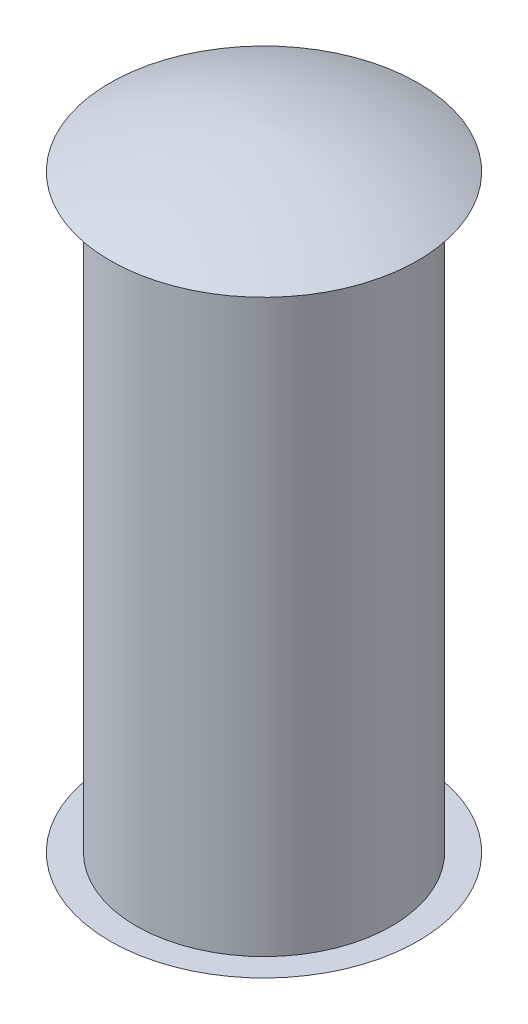
ISO-10303-21;
HEADER;
FILE_DESCRIPTION(('STEP AP214'),'2;1');
FILE_NAME('part.step','',(''),(''),'','','');
FILE_SCHEMA(('AUTOMOTIVE_DESIGN { 1 0 10303 214 1 1 1 1 }'));
ENDSEC;
DATA;
#1=APPLICATION_CONTEXT('core data for automotive mechanical design processes');
#2=APPLICATION_PROTOCOL_DEFINITION('international standard','automotive_design',2000,#1);
#3=PRODUCT_CONTEXT('',#1,'mechanical');
#4=PRODUCT('Part','Part','',(#3));
#5=PRODUCT_RELATED_PRODUCT_CATEGORY('part','',(#4));
#6=PRODUCT_DEFINITION_FORMATION('','',#4);
#7=PRODUCT_DEFINITION_CONTEXT('part definition',#1,'design');
#8=PRODUCT_DEFINITION('design','',#6,#7);
#9=PRODUCT_DEFINITION_SHAPE('','',#8);
#10=(LENGTH_UNIT() NAMED_UNIT(*) SI_UNIT(.MILLI.,.METRE.));
#11=(NAMED_UNIT(*) PLANE_ANGLE_UNIT() SI_UNIT($,.RADIAN.));
#12=(NAMED_UNIT(*) SI_UNIT($,.STERADIAN.) SOLID_ANGLE_UNIT());
#13=UNCERTAINTY_MEASURE_WITH_UNIT(LENGTH_MEASURE(1.E-05),#10,'distance_accuracy_value','');
#14=(GEOMETRIC_REPRESENTATION_CONTEXT(3) GLOBAL_UNCERTAINTY_ASSIGNED_CONTEXT((#13)) GLOBAL_UNIT_ASSIGNED_CONTEXT((#10,
#11,#12)) REPRESENTATION_CONTEXT('',''));
#15=CARTESIAN_POINT('',(0.,0.,0.));
#16=DIRECTION('',(0.,0.,1.));
#17=DIRECTION('',(1.,0.,0.));
#18=AXIS2_PLACEMENT_3D('',#15,#16,#17);
#19=CARTESIAN_POINT('',(0.,22.5,0.));
#20=DIRECTION('',(0.,-1.,0.));
#21=DIRECTION('',(0.,0.,-1.));
#22=AXIS2_PLACEMENT_3D('',#19,#20,#21);
#23=CYLINDRICAL_SURFACE('',#22,9.75);
#24=CARTESIAN_POINT('',(0.,22.5,0.));
#25=DIRECTION('',(0.,1.,0.));
#26=DIRECTION('',(0.,0.,1.));
#27=AXIS2_PLACEMENT_3D('',#24,#25,#26);
#28=CIRCLE('',#27,9.75);
#29=CARTESIAN_POINT('',(0.,22.5,9.75));
#30=VERTEX_POINT('',#29);
#31=EDGE_CURVE('E13',#30,#30,#28,.T.);
#32=ORIENTED_EDGE('',*,*,#31,.F.);
#33=EDGE_LOOP('',(#32));
#34=FACE_BOUND('',#33,.T.);
#35=CARTESIAN_POINT('',(0.,-22.5,0.));
#36=DIRECTION('',(0.,1.,0.));
#37=DIRECTION('',(0.,0.,1.));
#38=AXIS2_PLACEMENT_3D('',#35,#36,#37);
#39=CIRCLE('',#38,9.75);
#40=CARTESIAN_POINT('',(0.,-22.5,9.75));
#41=VERTEX_POINT('',#40);
#42=EDGE_CURVE('E67',#41,#41,#39,.T.);
#43=ORIENTED_EDGE('',*,*,#42,.T.);
#44=EDGE_LOOP('',(#43));
#45=FACE_BOUND('',#44,.T.);
#46=ADVANCED_FACE('F44',(#34,#45),#23,.T.);
#47=CARTESIAN_POINT('',(0.,-4.46762638446654,1.39333014071486));
#48=DIRECTION('',(-1.,0.,0.));
#49=DIRECTION('',(0.,0.,-1.));
#50=AXIS2_PLACEMENT_3D('',#47,#48,#49);
#51=CIRCLE('',#50,30.);
#52=TRIMMED_CURVE('',#51,(PARAMETER_VALUE(-1.52433527521043)),
(PARAMETER_VALUE(1.52433527521043)),.T.,.PARAMETER.);
#53=CARTESIAN_POINT('',(0.,-4.46762638446654,0.));
#54=DIRECTION('',(0.,-1.,0.));
#55=AXIS1_PLACEMENT('',#53,#54);
#56=SURFACE_OF_REVOLUTION('',#52,#55);
#57=CARTESIAN_POINT('',(0.,25.5,0.));
#58=VERTEX_POINT('',#57);
#59=VERTEX_LOOP('',#58);
#60=FACE_BOUND('',#59,.T.);
#61=CARTESIAN_POINT('',(0.,22.5,0.));
#62=DIRECTION('',(0.,-1.,0.));
#63=DIRECTION('',(0.,0.,-1.));
#64=AXIS2_PLACEMENT_3D('',#61,#62,#63);
#65=CIRCLE('',#64,11.75);
#66=CARTESIAN_POINT('',(0.,22.5,-11.75));
#67=VERTEX_POINT('',#66);
#68=EDGE_CURVE('E51',#67,#67,#65,.T.);
#69=ORIENTED_EDGE('',*,*,#68,.F.);
#70=EDGE_LOOP('',(#69));
#71=FACE_BOUND('',#70,.T.);
#72=ADVANCED_FACE('F75',(#60,#71),#56,.T.);
#73=CARTESIAN_POINT('',(0.,22.5,0.));
#74=DIRECTION('',(0.,-1.,0.));
#75=DIRECTION('',(0.,0.,-1.));
#76=AXIS2_PLACEMENT_3D('',#73,#74,#75);
#77=PLANE('',#76);
#78=ORIENTED_EDGE('',*,*,#31,.T.);
#79=EDGE_LOOP('',(#78));
#80=FACE_BOUND('',#79,.T.);
#81=ORIENTED_EDGE('',*,*,#68,.T.);
#82=EDGE_LOOP('',(#81));
#83=FACE_BOUND('',#82,.T.);
#84=ADVANCED_FACE('F61',(#80,#83),#77,.T.);
#85=CARTESIAN_POINT('',(0.,4.46762638446654,1.39333014071486));
#86=DIRECTION('',(1.,0.,0.));
#87=DIRECTION('',(0.,0.,-1.));
#88=AXIS2_PLACEMENT_3D('',#85,#86,#87);
#89=CIRCLE('',#88,30.);
#90=TRIMMED_CURVE('',#89,(PARAMETER_VALUE(-1.52433527521043)),
(PARAMETER_VALUE(1.52433527521043)),.T.,.PARAMETER.);
#91=CARTESIAN_POINT('',(0.,4.46762638446654,0.));
#92=DIRECTION('',(0.,1.,0.));
#93=AXIS1_PLACEMENT('',#91,#92);
#94=SURFACE_OF_REVOLUTION('',#90,#93);
#95=CARTESIAN_POINT('',(0.,-25.5,0.));
#96=VERTEX_POINT('',#95);
#97=VERTEX_LOOP('',#96);
#98=FACE_BOUND('',#97,.T.);
#99=CARTESIAN_POINT('',(0.,-22.5,0.));
#100=DIRECTION('',(0.,-1.,0.));
#101=DIRECTION('',(0.,0.,-1.));
#102=AXIS2_PLACEMENT_3D('',#99,#100,#101);
#103=CIRCLE('',#102,11.75);
#104=CARTESIAN_POINT('',(0.,-22.5,-11.75));
#105=VERTEX_POINT('',#104);
#106=EDGE_CURVE('E65',#105,#105,#103,.T.);
#107=ORIENTED_EDGE('',*,*,#106,.T.);
#108=EDGE_LOOP('',(#107));
#109=FACE_BOUND('',#108,.T.);
#110=ADVANCED_FACE('F57',(#98,#109),#94,.T.);
#111=CARTESIAN_POINT('',(0.,-22.5,0.));
#112=DIRECTION('',(0.,1.,0.));
#113=DIRECTION('',(0.,0.,-1.));
#114=AXIS2_PLACEMENT_3D('',#111,#112,#113);
#115=PLANE('',#114);
#116=ORIENTED_EDGE('',*,*,#42,.F.);
#117=EDGE_LOOP('',(#116));
#118=FACE_BOUND('',#117,.T.);
#119=ORIENTED_EDGE('',*,*,#106,.F.);
#120=EDGE_LOOP('',(#119));
#121=FACE_BOUND('',#120,.T.);
#122=ADVANCED_FACE('F60',(#118,#121),#115,.T.);
#123=CLOSED_SHELL('',(#46,#72,#84,#110,#122));
#124=MANIFOLD_SOLID_BREP('B2',#123);
#125=ADVANCED_BREP_SHAPE_REPRESENTATION('',(#18,#124),#14);
#126=SHAPE_DEFINITION_REPRESENTATION(#9,#125);
ENDSEC;
END-ISO-10303-21;
